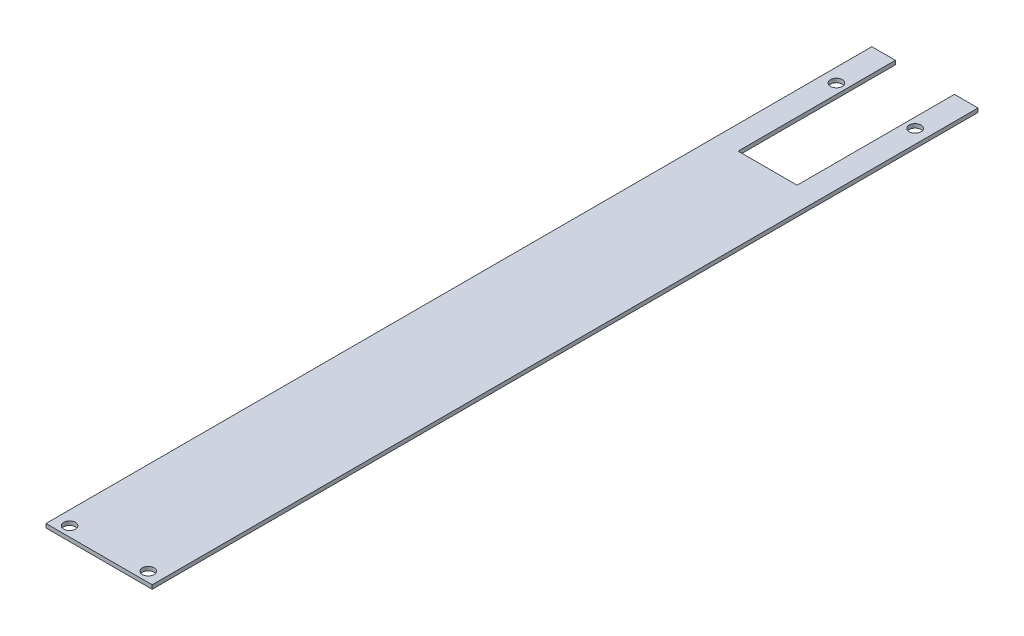
ISO-10303-21;
HEADER;
FILE_DESCRIPTION(('STEP AP214'),'2;1');
FILE_NAME('part.step','',(''),(''),'','','');
FILE_SCHEMA(('AUTOMOTIVE_DESIGN { 1 0 10303 214 1 1 1 1 }'));
ENDSEC;
DATA;
#1=APPLICATION_CONTEXT('core data for automotive mechanical design processes');
#2=APPLICATION_PROTOCOL_DEFINITION('international standard','automotive_design',2000,#1);
#3=PRODUCT_CONTEXT('',#1,'mechanical');
#4=PRODUCT('Part','Part','',(#3));
#5=PRODUCT_RELATED_PRODUCT_CATEGORY('part','',(#4));
#6=PRODUCT_DEFINITION_FORMATION('','',#4);
#7=PRODUCT_DEFINITION_CONTEXT('part definition',#1,'design');
#8=PRODUCT_DEFINITION('design','',#6,#7);
#9=PRODUCT_DEFINITION_SHAPE('','',#8);
#10=(LENGTH_UNIT() NAMED_UNIT(*) SI_UNIT(.MILLI.,.METRE.));
#11=(NAMED_UNIT(*) PLANE_ANGLE_UNIT() SI_UNIT($,.RADIAN.));
#12=(NAMED_UNIT(*) SI_UNIT($,.STERADIAN.) SOLID_ANGLE_UNIT());
#13=UNCERTAINTY_MEASURE_WITH_UNIT(LENGTH_MEASURE(1.E-05),#10,'distance_accuracy_value','');
#14=(GEOMETRIC_REPRESENTATION_CONTEXT(3) GLOBAL_UNCERTAINTY_ASSIGNED_CONTEXT((#13)) GLOBAL_UNIT_ASSIGNED_CONTEXT((#10,
#11,#12)) REPRESENTATION_CONTEXT('',''));
#15=CARTESIAN_POINT('',(0.,0.,0.));
#16=DIRECTION('',(0.,0.,1.));
#17=DIRECTION('',(1.,0.,0.));
#18=AXIS2_PLACEMENT_3D('',#15,#16,#17);
#19=CARTESIAN_POINT('',(-28.0517455341106,102.,-25.3078279612048));
#20=DIRECTION('',(0.,0.,1.));
#21=DIRECTION('',(1.,0.,0.));
#22=AXIS2_PLACEMENT_3D('',#19,#20,#21);
#23=PLANE('',#22);
#24=DIRECTION('',(-1.,0.,0.));
#25=VECTOR('',#24,1.);
#26=CARTESIAN_POINT('',(-28.0517455341106,102.,-25.3078279612048));
#27=LINE('',#26,#25);
#28=CARTESIAN_POINT('',(-16.0517455341106,102.,-25.3078279612048));
#29=VERTEX_POINT('',#28);
#30=CARTESIAN_POINT('',(-28.0517455341106,102.,-25.3078279612048));
#31=VERTEX_POINT('',#30);
#32=EDGE_CURVE('E57',#29,#31,#27,.T.);
#33=ORIENTED_EDGE('',*,*,#32,.F.);
#34=DIRECTION('',(0.,1.,0.));
#35=VECTOR('',#34,1.);
#36=CARTESIAN_POINT('',(-16.0517455341106,99.999,-25.3078279612048));
#37=LINE('',#36,#35);
#38=CARTESIAN_POINT('',(-16.0517455341106,100.,-25.3078279612048));
#39=VERTEX_POINT('',#38);
#40=EDGE_CURVE('E118',#39,#29,#37,.T.);
#41=ORIENTED_EDGE('',*,*,#40,.F.);
#42=DIRECTION('',(-1.,0.,0.));
#43=VECTOR('',#42,1.);
#44=CARTESIAN_POINT('',(-28.0517455341106,100.,-25.3078279612048));
#45=LINE('',#44,#43);
#46=CARTESIAN_POINT('',(-28.0517455341106,100.,-25.3078279612048));
#47=VERTEX_POINT('',#46);
#48=EDGE_CURVE('E79',#39,#47,#45,.T.);
#49=ORIENTED_EDGE('',*,*,#48,.T.);
#50=DIRECTION('',(0.,-1.,0.));
#51=VECTOR('',#50,1.);
#52=CARTESIAN_POINT('',(-28.0517455341106,102.,-25.3078279612048));
#53=LINE('',#52,#51);
#54=EDGE_CURVE('E141',#31,#47,#53,.T.);
#55=ORIENTED_EDGE('',*,*,#54,.F.);
#56=EDGE_LOOP('',(#33,#41,#49,#55));
#57=FACE_BOUND('',#56,.T.);
#58=ADVANCED_FACE('F33',(#57),#23,.F.);
#59=CARTESIAN_POINT('',(-28.0517455341106,102.,394.692172038795));
#60=DIRECTION('',(1.,0.,0.));
#61=DIRECTION('',(0.,0.,-1.));
#62=AXIS2_PLACEMENT_3D('',#59,#60,#61);
#63=PLANE('',#62);
#64=DIRECTION('',(0.,0.,1.));
#65=VECTOR('',#64,1.);
#66=CARTESIAN_POINT('',(-28.0517455341106,100.,394.692172038795));
#67=LINE('',#66,#65);
#68=CARTESIAN_POINT('',(-28.0517455341106,100.,394.692172038795));
#69=VERTEX_POINT('',#68);
#70=EDGE_CURVE('E151',#47,#69,#67,.T.);
#71=ORIENTED_EDGE('',*,*,#70,.T.);
#72=DIRECTION('',(0.,-1.,0.));
#73=VECTOR('',#72,1.);
#74=CARTESIAN_POINT('',(-28.0517455341106,102.,394.692172038795));
#75=LINE('',#74,#73);
#76=CARTESIAN_POINT('',(-28.0517455341106,102.,394.692172038795));
#77=VERTEX_POINT('',#76);
#78=EDGE_CURVE('E11',#77,#69,#75,.T.);
#79=ORIENTED_EDGE('',*,*,#78,.F.);
#80=DIRECTION('',(0.,0.,1.));
#81=VECTOR('',#80,1.);
#82=CARTESIAN_POINT('',(-28.0517455341106,102.,394.692172038795));
#83=LINE('',#82,#81);
#84=EDGE_CURVE('E134',#31,#77,#83,.T.);
#85=ORIENTED_EDGE('',*,*,#84,.F.);
#86=ORIENTED_EDGE('',*,*,#54,.T.);
#87=EDGE_LOOP('',(#71,#79,#85,#86));
#88=FACE_BOUND('',#87,.T.);
#89=ADVANCED_FACE('F35',(#88),#63,.F.);
#90=CARTESIAN_POINT('',(-28.0517455341106,102.,394.692172038795));
#91=DIRECTION('',(0.,0.,-1.));
#92=DIRECTION('',(-1.,0.,0.));
#93=AXIS2_PLACEMENT_3D('',#90,#91,#92);
#94=PLANE('',#93);
#95=DIRECTION('',(1.,0.,0.));
#96=VECTOR('',#95,1.);
#97=CARTESIAN_POINT('',(-28.0517455341106,100.,394.692172038795));
#98=LINE('',#97,#96);
#99=CARTESIAN_POINT('',(25.9482544658895,100.,394.692172038795));
#100=VERTEX_POINT('',#99);
#101=EDGE_CURVE('E150',#69,#100,#98,.T.);
#102=ORIENTED_EDGE('',*,*,#101,.T.);
#103=DIRECTION('',(0.,-1.,0.));
#104=VECTOR('',#103,1.);
#105=CARTESIAN_POINT('',(25.9482544658895,102.,394.692172038795));
#106=LINE('',#105,#104);
#107=CARTESIAN_POINT('',(25.9482544658895,102.,394.692172038795));
#108=VERTEX_POINT('',#107);
#109=EDGE_CURVE('E41',#108,#100,#106,.T.);
#110=ORIENTED_EDGE('',*,*,#109,.F.);
#111=DIRECTION('',(1.,0.,0.));
#112=VECTOR('',#111,1.);
#113=CARTESIAN_POINT('',(-28.0517455341106,102.,394.692172038795));
#114=LINE('',#113,#112);
#115=EDGE_CURVE('E86',#77,#108,#114,.T.);
#116=ORIENTED_EDGE('',*,*,#115,.F.);
#117=ORIENTED_EDGE('',*,*,#78,.T.);
#118=EDGE_LOOP('',(#102,#110,#116,#117));
#119=FACE_BOUND('',#118,.T.);
#120=ADVANCED_FACE('F213',(#119),#94,.F.);
#121=CARTESIAN_POINT('',(25.9482544658895,102.,394.692172038795));
#122=DIRECTION('',(-1.,0.,0.));
#123=DIRECTION('',(0.,0.,1.));
#124=AXIS2_PLACEMENT_3D('',#121,#122,#123);
#125=PLANE('',#124);
#126=DIRECTION('',(0.,0.,-1.));
#127=VECTOR('',#126,1.);
#128=CARTESIAN_POINT('',(25.9482544658895,100.,394.692172038795));
#129=LINE('',#128,#127);
#130=CARTESIAN_POINT('',(25.9482544658894,100.,-25.3078279612048));
#131=VERTEX_POINT('',#130);
#132=EDGE_CURVE('E137',#100,#131,#129,.T.);
#133=ORIENTED_EDGE('',*,*,#132,.T.);
#134=DIRECTION('',(0.,-1.,0.));
#135=VECTOR('',#134,1.);
#136=CARTESIAN_POINT('',(25.9482544658894,102.,-25.3078279612048));
#137=LINE('',#136,#135);
#138=CARTESIAN_POINT('',(25.9482544658894,102.,-25.3078279612048));
#139=VERTEX_POINT('',#138);
#140=EDGE_CURVE('E133',#139,#131,#137,.T.);
#141=ORIENTED_EDGE('',*,*,#140,.F.);
#142=DIRECTION('',(0.,0.,-1.));
#143=VECTOR('',#142,1.);
#144=CARTESIAN_POINT('',(25.9482544658895,102.,394.692172038795));
#145=LINE('',#144,#143);
#146=EDGE_CURVE('E148',#108,#139,#145,.T.);
#147=ORIENTED_EDGE('',*,*,#146,.F.);
#148=ORIENTED_EDGE('',*,*,#109,.T.);
#149=EDGE_LOOP('',(#133,#141,#147,#148));
#150=FACE_BOUND('',#149,.T.);
#151=ADVANCED_FACE('F147',(#150),#125,.F.);
#152=CARTESIAN_POINT('',(13.9482544658895,100.,-25.3078279612048));
#153=VERTEX_POINT('',#152);
#154=EDGE_CURVE('E125',#131,#153,#45,.T.);
#155=ORIENTED_EDGE('',*,*,#154,.T.);
#156=DIRECTION('',(0.,1.,0.));
#157=VECTOR('',#156,1.);
#158=CARTESIAN_POINT('',(13.9482544658895,99.999,-25.3078279612048));
#159=LINE('',#158,#157);
#160=CARTESIAN_POINT('',(13.9482544658895,102.,-25.3078279612048));
#161=VERTEX_POINT('',#160);
#162=EDGE_CURVE('E107',#153,#161,#159,.T.);
#163=ORIENTED_EDGE('',*,*,#162,.T.);
#164=EDGE_CURVE('E143',#139,#161,#27,.T.);
#165=ORIENTED_EDGE('',*,*,#164,.F.);
#166=ORIENTED_EDGE('',*,*,#140,.T.);
#167=EDGE_LOOP('',(#155,#163,#165,#166));
#168=FACE_BOUND('',#167,.T.);
#169=ADVANCED_FACE('F131',(#168),#23,.F.);
#170=CARTESIAN_POINT('',(-28.0517455341106,102.,-25.3078279612048));
#171=DIRECTION('',(0.,-1.,0.));
#172=DIRECTION('',(0.,0.,-1.));
#173=AXIS2_PLACEMENT_3D('',#170,#171,#172);
#174=PLANE('',#173);
#175=CARTESIAN_POINT('',(18.9482544658894,102.,389.692172038795));
#176=DIRECTION('',(0.,1.,0.));
#177=DIRECTION('',(0.,0.,1.));
#178=AXIS2_PLACEMENT_3D('',#175,#176,#177);
#179=CIRCLE('',#178,3.);
#180=CARTESIAN_POINT('',(18.9482544658894,102.,392.692172038795));
#181=VERTEX_POINT('',#180);
#182=EDGE_CURVE('E185',#181,#181,#179,.T.);
#183=ORIENTED_EDGE('',*,*,#182,.F.);
#184=EDGE_LOOP('',(#183));
#185=FACE_BOUND('',#184,.T.);
#186=CARTESIAN_POINT('',(-21.0517455341106,102.,389.692172038795));
#187=DIRECTION('',(0.,1.,0.));
#188=DIRECTION('',(0.,0.,1.));
#189=AXIS2_PLACEMENT_3D('',#186,#187,#188);
#190=CIRCLE('',#189,3.);
#191=CARTESIAN_POINT('',(-21.0517455341106,102.,392.692172038795));
#192=VERTEX_POINT('',#191);
#193=EDGE_CURVE('E179',#192,#192,#190,.T.);
#194=ORIENTED_EDGE('',*,*,#193,.F.);
#195=EDGE_LOOP('',(#194));
#196=FACE_BOUND('',#195,.T.);
#197=CARTESIAN_POINT('',(-21.0517455341106,102.,-0.307827961204842));
#198=DIRECTION('',(0.,1.,0.));
#199=DIRECTION('',(0.,0.,1.));
#200=AXIS2_PLACEMENT_3D('',#197,#198,#199);
#201=CIRCLE('',#200,3.);
#202=CARTESIAN_POINT('',(-21.0517455341106,102.,2.69217203879516));
#203=VERTEX_POINT('',#202);
#204=EDGE_CURVE('E173',#203,#203,#201,.T.);
#205=ORIENTED_EDGE('',*,*,#204,.F.);
#206=EDGE_LOOP('',(#205));
#207=FACE_BOUND('',#206,.T.);
#208=CARTESIAN_POINT('',(18.9482544658894,102.,-0.307827961204842));
#209=DIRECTION('',(0.,1.,0.));
#210=DIRECTION('',(0.,0.,1.));
#211=AXIS2_PLACEMENT_3D('',#208,#209,#210);
#212=CIRCLE('',#211,3.);
#213=CARTESIAN_POINT('',(18.9482544658894,102.,2.69217203879516));
#214=VERTEX_POINT('',#213);
#215=EDGE_CURVE('E128',#214,#214,#212,.T.);
#216=ORIENTED_EDGE('',*,*,#215,.F.);
#217=EDGE_LOOP('',(#216));
#218=FACE_BOUND('',#217,.T.);
#219=DIRECTION('',(1.,0.,0.));
#220=VECTOR('',#219,1.);
#221=CARTESIAN_POINT('',(-16.0517455341106,102.,54.6921720387952));
#222=LINE('',#221,#220);
#223=CARTESIAN_POINT('',(-16.0517455341106,102.,54.6921720387952));
#224=VERTEX_POINT('',#223);
#225=CARTESIAN_POINT('',(13.9482544658895,102.,54.6921720387951));
#226=VERTEX_POINT('',#225);
#227=EDGE_CURVE('E164',#224,#226,#222,.T.);
#228=ORIENTED_EDGE('',*,*,#227,.F.);
#229=DIRECTION('',(0.,0.,1.));
#230=VECTOR('',#229,1.);
#231=CARTESIAN_POINT('',(-16.0517455341106,102.,-25.3078279612048));
#232=LINE('',#231,#230);
#233=EDGE_CURVE('E166',#29,#224,#232,.T.);
#234=ORIENTED_EDGE('',*,*,#233,.F.);
#235=ORIENTED_EDGE('',*,*,#32,.T.);
#236=ORIENTED_EDGE('',*,*,#84,.T.);
#237=ORIENTED_EDGE('',*,*,#115,.T.);
#238=ORIENTED_EDGE('',*,*,#146,.T.);
#239=ORIENTED_EDGE('',*,*,#164,.T.);
#240=DIRECTION('',(0.,0.,-1.));
#241=VECTOR('',#240,1.);
#242=CARTESIAN_POINT('',(13.9482544658895,102.,-25.3078279612048));
#243=LINE('',#242,#241);
#244=EDGE_CURVE('E113',#226,#161,#243,.T.);
#245=ORIENTED_EDGE('',*,*,#244,.F.);
#246=EDGE_LOOP('',(#228,#234,#235,#236,#237,#238,#239,#245));
#247=FACE_BOUND('',#246,.T.);
#248=ADVANCED_FACE('F196',(#185,#196,#207,#218,#247),#174,.F.);
#249=CARTESIAN_POINT('',(-28.0517455341106,100.,-25.3078279612048));
#250=DIRECTION('',(0.,-1.,0.));
#251=DIRECTION('',(0.,0.,-1.));
#252=AXIS2_PLACEMENT_3D('',#249,#250,#251);
#253=PLANE('',#252);
#254=CARTESIAN_POINT('',(18.9482544658894,100.,389.692172038795));
#255=DIRECTION('',(0.,-1.,0.));
#256=DIRECTION('',(0.,0.,-1.));
#257=AXIS2_PLACEMENT_3D('',#254,#255,#256);
#258=CIRCLE('',#257,3.);
#259=CARTESIAN_POINT('',(18.9482544658894,100.,386.692172038795));
#260=VERTEX_POINT('',#259);
#261=EDGE_CURVE('E188',#260,#260,#258,.F.);
#262=ORIENTED_EDGE('',*,*,#261,.T.);
#263=EDGE_LOOP('',(#262));
#264=FACE_BOUND('',#263,.T.);
#265=CARTESIAN_POINT('',(-21.0517455341106,100.,389.692172038795));
#266=DIRECTION('',(0.,-1.,0.));
#267=DIRECTION('',(0.,0.,-1.));
#268=AXIS2_PLACEMENT_3D('',#265,#266,#267);
#269=CIRCLE('',#268,3.);
#270=CARTESIAN_POINT('',(-21.0517455341106,100.,386.692172038795));
#271=VERTEX_POINT('',#270);
#272=EDGE_CURVE('E182',#271,#271,#269,.F.);
#273=ORIENTED_EDGE('',*,*,#272,.T.);
#274=EDGE_LOOP('',(#273));
#275=FACE_BOUND('',#274,.T.);
#276=CARTESIAN_POINT('',(-21.0517455341106,100.,-0.307827961204842));
#277=DIRECTION('',(0.,-1.,0.));
#278=DIRECTION('',(0.,0.,-1.));
#279=AXIS2_PLACEMENT_3D('',#276,#277,#278);
#280=CIRCLE('',#279,3.);
#281=CARTESIAN_POINT('',(-21.0517455341106,100.,-3.30782796120484));
#282=VERTEX_POINT('',#281);
#283=EDGE_CURVE('E176',#282,#282,#280,.F.);
#284=ORIENTED_EDGE('',*,*,#283,.T.);
#285=EDGE_LOOP('',(#284));
#286=FACE_BOUND('',#285,.T.);
#287=CARTESIAN_POINT('',(18.9482544658894,100.,-0.307827961204842));
#288=DIRECTION('',(0.,-1.,0.));
#289=DIRECTION('',(0.,0.,-1.));
#290=AXIS2_PLACEMENT_3D('',#287,#288,#289);
#291=CIRCLE('',#290,3.);
#292=CARTESIAN_POINT('',(18.9482544658894,100.,-3.30782796120484));
#293=VERTEX_POINT('',#292);
#294=EDGE_CURVE('E170',#293,#293,#291,.F.);
#295=ORIENTED_EDGE('',*,*,#294,.T.);
#296=EDGE_LOOP('',(#295));
#297=FACE_BOUND('',#296,.T.);
#298=DIRECTION('',(0.,0.,1.));
#299=VECTOR('',#298,1.);
#300=CARTESIAN_POINT('',(-16.0517455341106,100.,-25.3078279612048));
#301=LINE('',#300,#299);
#302=CARTESIAN_POINT('',(-16.0517455341106,100.,54.6921720387952));
#303=VERTEX_POINT('',#302);
#304=EDGE_CURVE('E127',#39,#303,#301,.T.);
#305=ORIENTED_EDGE('',*,*,#304,.T.);
#306=DIRECTION('',(1.,0.,0.));
#307=VECTOR('',#306,1.);
#308=CARTESIAN_POINT('',(-16.0517455341106,100.,54.6921720387952));
#309=LINE('',#308,#307);
#310=CARTESIAN_POINT('',(13.9482544658895,100.,54.6921720387951));
#311=VERTEX_POINT('',#310);
#312=EDGE_CURVE('E126',#303,#311,#309,.T.);
#313=ORIENTED_EDGE('',*,*,#312,.T.);
#314=DIRECTION('',(0.,0.,-1.));
#315=VECTOR('',#314,1.);
#316=CARTESIAN_POINT('',(13.9482544658895,100.,-25.3078279612048));
#317=LINE('',#316,#315);
#318=EDGE_CURVE('E110',#311,#153,#317,.T.);
#319=ORIENTED_EDGE('',*,*,#318,.T.);
#320=ORIENTED_EDGE('',*,*,#154,.F.);
#321=ORIENTED_EDGE('',*,*,#132,.F.);
#322=ORIENTED_EDGE('',*,*,#101,.F.);
#323=ORIENTED_EDGE('',*,*,#70,.F.);
#324=ORIENTED_EDGE('',*,*,#48,.F.);
#325=EDGE_LOOP('',(#305,#313,#319,#320,#321,#322,#323,#324));
#326=FACE_BOUND('',#325,.T.);
#327=ADVANCED_FACE('F123',(#264,#275,#286,#297,#326),#253,.T.);
#328=CARTESIAN_POINT('',(-16.0517455341106,99.999,-25.3078279612048));
#329=DIRECTION('',(-1.,0.,0.));
#330=DIRECTION('',(0.,0.,1.));
#331=AXIS2_PLACEMENT_3D('',#328,#329,#330);
#332=PLANE('',#331);
#333=ORIENTED_EDGE('',*,*,#40,.T.);
#334=ORIENTED_EDGE('',*,*,#233,.T.);
#335=DIRECTION('',(0.,1.,0.));
#336=VECTOR('',#335,1.);
#337=CARTESIAN_POINT('',(-16.0517455341106,99.999,54.6921720387952));
#338=LINE('',#337,#336);
#339=EDGE_CURVE('E159',#303,#224,#338,.T.);
#340=ORIENTED_EDGE('',*,*,#339,.F.);
#341=ORIENTED_EDGE('',*,*,#304,.F.);
#342=EDGE_LOOP('',(#333,#334,#340,#341));
#343=FACE_BOUND('',#342,.T.);
#344=ADVANCED_FACE('F209',(#343),#332,.F.);
#345=CARTESIAN_POINT('',(13.9482544658895,99.999,-25.3078279612048));
#346=DIRECTION('',(1.,0.,0.));
#347=DIRECTION('',(0.,0.,-1.));
#348=AXIS2_PLACEMENT_3D('',#345,#346,#347);
#349=PLANE('',#348);
#350=DIRECTION('',(0.,1.,0.));
#351=VECTOR('',#350,1.);
#352=CARTESIAN_POINT('',(13.9482544658895,99.999,54.6921720387951));
#353=LINE('',#352,#351);
#354=EDGE_CURVE('E48',#311,#226,#353,.T.);
#355=ORIENTED_EDGE('',*,*,#354,.T.);
#356=ORIENTED_EDGE('',*,*,#244,.T.);
#357=ORIENTED_EDGE('',*,*,#162,.F.);
#358=ORIENTED_EDGE('',*,*,#318,.F.);
#359=EDGE_LOOP('',(#355,#356,#357,#358));
#360=FACE_BOUND('',#359,.T.);
#361=ADVANCED_FACE('F109',(#360),#349,.F.);
#362=CARTESIAN_POINT('',(-16.0517455341106,99.999,54.6921720387952));
#363=DIRECTION('',(0.,0.,1.));
#364=DIRECTION('',(1.,0.,0.));
#365=AXIS2_PLACEMENT_3D('',#362,#363,#364);
#366=PLANE('',#365);
#367=ORIENTED_EDGE('',*,*,#339,.T.);
#368=ORIENTED_EDGE('',*,*,#227,.T.);
#369=ORIENTED_EDGE('',*,*,#354,.F.);
#370=ORIENTED_EDGE('',*,*,#312,.F.);
#371=EDGE_LOOP('',(#367,#368,#369,#370));
#372=FACE_BOUND('',#371,.T.);
#373=ADVANCED_FACE('F206',(#372),#366,.F.);
#374=CARTESIAN_POINT('',(18.9482544658894,99.999,-0.307827961204842));
#375=DIRECTION('',(0.,1.,0.));
#376=DIRECTION('',(0.,0.,1.));
#377=AXIS2_PLACEMENT_3D('',#374,#375,#376);
#378=CYLINDRICAL_SURFACE('',#377,3.);
#379=ORIENTED_EDGE('',*,*,#294,.F.);
#380=EDGE_LOOP('',(#379));
#381=FACE_BOUND('',#380,.T.);
#382=ORIENTED_EDGE('',*,*,#215,.T.);
#383=EDGE_LOOP('',(#382));
#384=FACE_BOUND('',#383,.T.);
#385=ADVANCED_FACE('F259',(#381,#384),#378,.F.);
#386=CARTESIAN_POINT('',(-21.0517455341106,99.999,-0.307827961204842));
#387=DIRECTION('',(0.,1.,0.));
#388=DIRECTION('',(0.,0.,1.));
#389=AXIS2_PLACEMENT_3D('',#386,#387,#388);
#390=CYLINDRICAL_SURFACE('',#389,3.);
#391=ORIENTED_EDGE('',*,*,#283,.F.);
#392=EDGE_LOOP('',(#391));
#393=FACE_BOUND('',#392,.T.);
#394=ORIENTED_EDGE('',*,*,#204,.T.);
#395=EDGE_LOOP('',(#394));
#396=FACE_BOUND('',#395,.T.);
#397=ADVANCED_FACE('F265',(#393,#396),#390,.F.);
#398=CARTESIAN_POINT('',(-21.0517455341106,99.999,389.692172038795));
#399=DIRECTION('',(0.,1.,0.));
#400=DIRECTION('',(0.,0.,1.));
#401=AXIS2_PLACEMENT_3D('',#398,#399,#400);
#402=CYLINDRICAL_SURFACE('',#401,3.);
#403=ORIENTED_EDGE('',*,*,#272,.F.);
#404=EDGE_LOOP('',(#403));
#405=FACE_BOUND('',#404,.T.);
#406=ORIENTED_EDGE('',*,*,#193,.T.);
#407=EDGE_LOOP('',(#406));
#408=FACE_BOUND('',#407,.T.);
#409=ADVANCED_FACE('F273',(#405,#408),#402,.F.);
#410=CARTESIAN_POINT('',(18.9482544658894,99.999,389.692172038795));
#411=DIRECTION('',(0.,1.,0.));
#412=DIRECTION('',(0.,0.,1.));
#413=AXIS2_PLACEMENT_3D('',#410,#411,#412);
#414=CYLINDRICAL_SURFACE('',#413,3.);
#415=ORIENTED_EDGE('',*,*,#261,.F.);
#416=EDGE_LOOP('',(#415));
#417=FACE_BOUND('',#416,.T.);
#418=ORIENTED_EDGE('',*,*,#182,.T.);
#419=EDGE_LOOP('',(#418));
#420=FACE_BOUND('',#419,.T.);
#421=ADVANCED_FACE('F194',(#417,#420),#414,.F.);
#422=CLOSED_SHELL('',(#58,#89,#120,#151,#169,#248,#327,#344,#361,#373,#385,#397,#409,#421));
#423=MANIFOLD_SOLID_BREP('B2',#422);
#424=ADVANCED_BREP_SHAPE_REPRESENTATION('',(#18,#423),#14);
#425=SHAPE_DEFINITION_REPRESENTATION(#9,#424);
ENDSEC;
END-ISO-10303-21;
